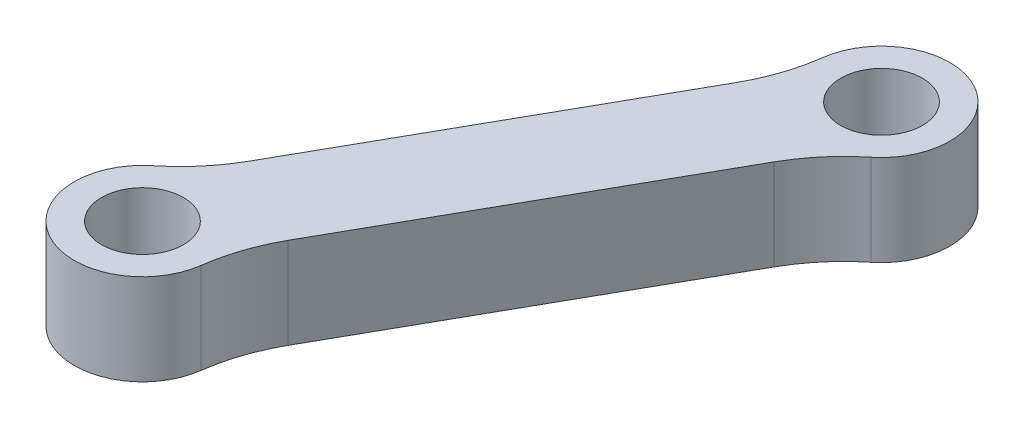
ISO-10303-21;
HEADER;
FILE_DESCRIPTION(('STEP AP214'),'2;1');
FILE_NAME('part.step','',(''),(''),'','','');
FILE_SCHEMA(('AUTOMOTIVE_DESIGN { 1 0 10303 214 1 1 1 1 }'));
ENDSEC;
DATA;
#1=APPLICATION_CONTEXT('core data for automotive mechanical design processes');
#2=APPLICATION_PROTOCOL_DEFINITION('international standard','automotive_design',2000,#1);
#3=PRODUCT_CONTEXT('',#1,'mechanical');
#4=PRODUCT('Part','Part','',(#3));
#5=PRODUCT_RELATED_PRODUCT_CATEGORY('part','',(#4));
#6=PRODUCT_DEFINITION_FORMATION('','',#4);
#7=PRODUCT_DEFINITION_CONTEXT('part definition',#1,'design');
#8=PRODUCT_DEFINITION('design','',#6,#7);
#9=PRODUCT_DEFINITION_SHAPE('','',#8);
#10=(LENGTH_UNIT() NAMED_UNIT(*) SI_UNIT(.MILLI.,.METRE.));
#11=(NAMED_UNIT(*) PLANE_ANGLE_UNIT() SI_UNIT($,.RADIAN.));
#12=(NAMED_UNIT(*) SI_UNIT($,.STERADIAN.) SOLID_ANGLE_UNIT());
#13=UNCERTAINTY_MEASURE_WITH_UNIT(LENGTH_MEASURE(1.E-05),#10,'distance_accuracy_value','');
#14=(GEOMETRIC_REPRESENTATION_CONTEXT(3) GLOBAL_UNCERTAINTY_ASSIGNED_CONTEXT((#13)) GLOBAL_UNIT_ASSIGNED_CONTEXT((#10,
#11,#12)) REPRESENTATION_CONTEXT('',''));
#15=CARTESIAN_POINT('',(0.,0.,0.));
#16=DIRECTION('',(0.,0.,1.));
#17=DIRECTION('',(1.,0.,0.));
#18=AXIS2_PLACEMENT_3D('',#15,#16,#17);
#19=CARTESIAN_POINT('',(-0.531717418692566,-58.,-21.5120788638868));
#20=DIRECTION('',(0.,-1.,0.));
#21=DIRECTION('',(0.,0.,-1.));
#22=AXIS2_PLACEMENT_3D('',#19,#20,#21);
#23=CYLINDRICAL_SURFACE('',#22,9.99999999999997);
#24=CARTESIAN_POINT('',(-0.531717418692566,-63.,-21.5120788638868));
#25=DIRECTION('',(0.,1.,0.));
#26=DIRECTION('',(0.,0.,1.));
#27=AXIS2_PLACEMENT_3D('',#24,#25,#26);
#28=CIRCLE('',#27,9.99999999999997);
#29=CARTESIAN_POINT('',(5.73851095756386,-63.,-13.7220701277179));
#30=VERTEX_POINT('',#29);
#31=CARTESIAN_POINT('',(8.18192841407054,-63.,-16.6057180637448));
#32=VERTEX_POINT('',#31);
#33=EDGE_CURVE('E142',#30,#32,#28,.T.);
#34=ORIENTED_EDGE('',*,*,#33,.F.);
#35=DIRECTION('',(0.,-1.,0.));
#36=VECTOR('',#35,1.);
#37=CARTESIAN_POINT('',(5.73851095756386,-58.,-13.7220701277179));
#38=LINE('',#37,#36);
#39=CARTESIAN_POINT('',(5.73851095756386,-58.,-13.7220701277179));
#40=VERTEX_POINT('',#39);
#41=EDGE_CURVE('E11',#40,#30,#38,.T.);
#42=ORIENTED_EDGE('',*,*,#41,.F.);
#43=CARTESIAN_POINT('',(-0.531717418692566,-58.,-21.5120788638868));
#44=DIRECTION('',(0.,1.,0.));
#45=DIRECTION('',(0.,0.,1.));
#46=AXIS2_PLACEMENT_3D('',#43,#44,#45);
#47=CIRCLE('',#46,9.99999999999997);
#48=CARTESIAN_POINT('',(8.18192841407054,-58.,-16.6057180637448));
#49=VERTEX_POINT('',#48);
#50=EDGE_CURVE('E171',#40,#49,#47,.T.);
#51=ORIENTED_EDGE('',*,*,#50,.T.);
#52=DIRECTION('',(0.,-1.,0.));
#53=VECTOR('',#52,1.);
#54=CARTESIAN_POINT('',(8.18192841407054,-58.,-16.6057180637448));
#55=LINE('',#54,#53);
#56=EDGE_CURVE('E42',#49,#32,#55,.T.);
#57=ORIENTED_EDGE('',*,*,#56,.T.);
#58=EDGE_LOOP('',(#34,#42,#51,#57));
#59=FACE_BOUND('',#58,.T.);
#60=ADVANCED_FACE('F39',(#59),#23,.F.);
#61=CARTESIAN_POINT('',(8.08984659866003,-58.,-10.8008168516545));
#62=DIRECTION('',(0.,-1.,0.));
#63=DIRECTION('',(0.,0.,-1.));
#64=AXIS2_PLACEMENT_3D('',#61,#62,#63);
#65=CYLINDRICAL_SURFACE('',#64,3.75000000000002);
#66=CARTESIAN_POINT('',(8.08984659866003,-63.,-10.8008168516545));
#67=DIRECTION('',(0.,-1.,0.));
#68=DIRECTION('',(0.,0.,-1.));
#69=AXIS2_PLACEMENT_3D('',#66,#67,#68);
#70=CIRCLE('',#69,3.75000000000002);
#71=CARTESIAN_POINT('',(11.8069428768096,-63.,-10.3051402847618));
#72=VERTEX_POINT('',#71);
#73=EDGE_CURVE('E168',#72,#30,#70,.T.);
#74=ORIENTED_EDGE('',*,*,#73,.F.);
#75=DIRECTION('',(0.,-1.,0.));
#76=VECTOR('',#75,1.);
#77=CARTESIAN_POINT('',(11.8069428768096,-58.,-10.3051402847618));
#78=LINE('',#77,#76);
#79=CARTESIAN_POINT('',(11.8069428768096,-58.,-10.3051402847618));
#80=VERTEX_POINT('',#79);
#81=EDGE_CURVE('E49',#80,#72,#78,.T.);
#82=ORIENTED_EDGE('',*,*,#81,.F.);
#83=CARTESIAN_POINT('',(8.08984659866003,-58.,-10.8008168516545));
#84=DIRECTION('',(0.,-1.,0.));
#85=DIRECTION('',(0.,0.,-1.));
#86=AXIS2_PLACEMENT_3D('',#83,#84,#85);
#87=CIRCLE('',#86,3.75000000000002);
#88=EDGE_CURVE('E128',#80,#40,#87,.T.);
#89=ORIENTED_EDGE('',*,*,#88,.T.);
#90=ORIENTED_EDGE('',*,*,#41,.T.);
#91=EDGE_LOOP('',(#74,#82,#89,#90));
#92=FACE_BOUND('',#91,.T.);
#93=ADVANCED_FACE('F189',(#92),#65,.T.);
#94=CARTESIAN_POINT('',(21.7191996185418,-58.,-8.9833361063813));
#95=DIRECTION('',(0.,-1.,0.));
#96=DIRECTION('',(0.,0.,-1.));
#97=AXIS2_PLACEMENT_3D('',#94,#95,#96);
#98=CYLINDRICAL_SURFACE('',#97,9.99999999999997);
#99=CARTESIAN_POINT('',(21.7191996185418,-63.,-8.9833361063813));
#100=DIRECTION('',(0.,1.,0.));
#101=DIRECTION('',(0.,0.,1.));
#102=AXIS2_PLACEMENT_3D('',#99,#100,#101);
#103=CIRCLE('',#102,9.99999999999997);
#104=CARTESIAN_POINT('',(13.0055537857787,-63.,-13.8896969065233));
#105=VERTEX_POINT('',#104);
#106=EDGE_CURVE('E114',#105,#72,#103,.T.);
#107=ORIENTED_EDGE('',*,*,#106,.F.);
#108=DIRECTION('',(0.,-1.,0.));
#109=VECTOR('',#108,1.);
#110=CARTESIAN_POINT('',(13.0055537857787,-58.,-13.8896969065233));
#111=LINE('',#110,#109);
#112=CARTESIAN_POINT('',(13.0055537857787,-58.,-13.8896969065233));
#113=VERTEX_POINT('',#112);
#114=EDGE_CURVE('E109',#113,#105,#111,.T.);
#115=ORIENTED_EDGE('',*,*,#114,.F.);
#116=CARTESIAN_POINT('',(21.7191996185418,-58.,-8.9833361063813));
#117=DIRECTION('',(0.,1.,0.));
#118=DIRECTION('',(0.,0.,1.));
#119=AXIS2_PLACEMENT_3D('',#116,#117,#118);
#120=CIRCLE('',#119,9.99999999999997);
#121=EDGE_CURVE('E112',#113,#80,#120,.T.);
#122=ORIENTED_EDGE('',*,*,#121,.T.);
#123=ORIENTED_EDGE('',*,*,#81,.T.);
#124=EDGE_LOOP('',(#107,#115,#122,#123));
#125=FACE_BOUND('',#124,.T.);
#126=ADVANCED_FACE('F111',(#125),#98,.F.);
#127=CARTESIAN_POINT('',(22.6257964745386,-58.,-30.9751480239088));
#128=DIRECTION('',(0.871364583276312,0.,0.490636080014199));
#129=DIRECTION('',(0.490636080014199,0.,-0.871364583276312));
#130=AXIS2_PLACEMENT_3D('',#127,#128,#129);
#131=PLANE('',#130);
#132=DIRECTION('',(-0.490636080014198,0.,0.871364583276312));
#133=VECTOR('',#132,1.);
#134=CARTESIAN_POINT('',(22.6257964745386,-63.,-30.9751480239088));
#135=LINE('',#134,#133);
#136=CARTESIAN_POINT('',(22.6257964745386,-63.,-30.9751480239088));
#137=VERTEX_POINT('',#136);
#138=EDGE_CURVE('E163',#137,#105,#135,.T.);
#139=ORIENTED_EDGE('',*,*,#138,.F.);
#140=DIRECTION('',(0.,-1.,0.));
#141=VECTOR('',#140,1.);
#142=CARTESIAN_POINT('',(22.6257964745386,-58.,-30.9751480239088));
#143=LINE('',#142,#141);
#144=CARTESIAN_POINT('',(22.6257964745386,-58.,-30.9751480239088));
#145=VERTEX_POINT('',#144);
#146=EDGE_CURVE('E120',#145,#137,#143,.T.);
#147=ORIENTED_EDGE('',*,*,#146,.F.);
#148=DIRECTION('',(-0.490636080014198,0.,0.871364583276312));
#149=VECTOR('',#148,1.);
#150=CARTESIAN_POINT('',(22.6257964745386,-58.,-30.9751480239088));
#151=LINE('',#150,#149);
#152=EDGE_CURVE('E126',#145,#113,#151,.T.);
#153=ORIENTED_EDGE('',*,*,#152,.T.);
#154=ORIENTED_EDGE('',*,*,#114,.T.);
#155=EDGE_LOOP('',(#139,#147,#153,#154));
#156=FACE_BOUND('',#155,.T.);
#157=ADVANCED_FACE('F131',(#156),#131,.T.);
#158=CARTESIAN_POINT('',(31.3394423073017,-58.,-26.0687872237669));
#159=DIRECTION('',(0.,-1.,0.));
#160=DIRECTION('',(0.,0.,-1.));
#161=AXIS2_PLACEMENT_3D('',#158,#159,#160);
#162=CYLINDRICAL_SURFACE('',#161,9.99999999999996);
#163=CARTESIAN_POINT('',(31.3394423073017,-63.,-26.0687872237669));
#164=DIRECTION('',(0.,1.,0.));
#165=DIRECTION('',(0.,0.,1.));
#166=AXIS2_PLACEMENT_3D('',#163,#164,#165);
#167=CIRCLE('',#166,9.99999999999996);
#168=CARTESIAN_POINT('',(25.0692139310453,-63.,-33.8587959599358));
#169=VERTEX_POINT('',#168);
#170=EDGE_CURVE('E159',#169,#137,#167,.T.);
#171=ORIENTED_EDGE('',*,*,#170,.F.);
#172=DIRECTION('',(0.,-1.,0.));
#173=VECTOR('',#172,1.);
#174=CARTESIAN_POINT('',(25.0692139310453,-58.,-33.8587959599358));
#175=LINE('',#174,#173);
#176=CARTESIAN_POINT('',(25.0692139310453,-58.,-33.8587959599358));
#177=VERTEX_POINT('',#176);
#178=EDGE_CURVE('E177',#177,#169,#175,.T.);
#179=ORIENTED_EDGE('',*,*,#178,.F.);
#180=CARTESIAN_POINT('',(31.3394423073017,-58.,-26.0687872237669));
#181=DIRECTION('',(0.,1.,0.));
#182=DIRECTION('',(0.,0.,1.));
#183=AXIS2_PLACEMENT_3D('',#180,#181,#182);
#184=CIRCLE('',#183,9.99999999999996);
#185=EDGE_CURVE('E133',#177,#145,#184,.T.);
#186=ORIENTED_EDGE('',*,*,#185,.T.);
#187=ORIENTED_EDGE('',*,*,#146,.T.);
#188=EDGE_LOOP('',(#171,#179,#186,#187));
#189=FACE_BOUND('',#188,.T.);
#190=ADVANCED_FACE('F202',(#189),#162,.F.);
#191=CARTESIAN_POINT('',(22.7178782899491,-58.,-36.7800492359991));
#192=DIRECTION('',(0.,-1.,0.));
#193=DIRECTION('',(0.,0.,-1.));
#194=AXIS2_PLACEMENT_3D('',#191,#192,#193);
#195=CYLINDRICAL_SURFACE('',#194,3.75);
#196=CARTESIAN_POINT('',(22.7178782899491,-63.,-36.7800492359991));
#197=DIRECTION('',(0.,-1.,0.));
#198=DIRECTION('',(0.,0.,-1.));
#199=AXIS2_PLACEMENT_3D('',#196,#197,#198);
#200=CIRCLE('',#199,3.75);
#201=CARTESIAN_POINT('',(19.0007820117995,-63.,-37.2757258028918));
#202=VERTEX_POINT('',#201);
#203=EDGE_CURVE('E155',#202,#169,#200,.T.);
#204=ORIENTED_EDGE('',*,*,#203,.F.);
#205=DIRECTION('',(0.,-1.,0.));
#206=VECTOR('',#205,1.);
#207=CARTESIAN_POINT('',(19.0007820117995,-58.,-37.2757258028918));
#208=LINE('',#207,#206);
#209=CARTESIAN_POINT('',(19.0007820117995,-58.,-37.2757258028918));
#210=VERTEX_POINT('',#209);
#211=EDGE_CURVE('E180',#210,#202,#208,.T.);
#212=ORIENTED_EDGE('',*,*,#211,.F.);
#213=CARTESIAN_POINT('',(22.7178782899491,-58.,-36.7800492359991));
#214=DIRECTION('',(0.,-1.,0.));
#215=DIRECTION('',(0.,0.,-1.));
#216=AXIS2_PLACEMENT_3D('',#213,#214,#215);
#217=CIRCLE('',#216,3.75);
#218=EDGE_CURVE('E136',#210,#177,#217,.T.);
#219=ORIENTED_EDGE('',*,*,#218,.T.);
#220=ORIENTED_EDGE('',*,*,#178,.T.);
#221=EDGE_LOOP('',(#204,#212,#219,#220));
#222=FACE_BOUND('',#221,.T.);
#223=ADVANCED_FACE('F205',(#222),#195,.T.);
#224=CARTESIAN_POINT('',(9.0885252700673,-58.,-38.5975299812723));
#225=DIRECTION('',(0.,-1.,0.));
#226=DIRECTION('',(0.,0.,-1.));
#227=AXIS2_PLACEMENT_3D('',#224,#225,#226);
#228=CYLINDRICAL_SURFACE('',#227,9.99999999999998);
#229=CARTESIAN_POINT('',(9.0885252700673,-63.,-38.5975299812723));
#230=DIRECTION('',(0.,1.,0.));
#231=DIRECTION('',(0.,0.,1.));
#232=AXIS2_PLACEMENT_3D('',#229,#230,#231);
#233=CIRCLE('',#232,9.99999999999998);
#234=CARTESIAN_POINT('',(17.8021711028304,-63.,-33.6911691811303));
#235=VERTEX_POINT('',#234);
#236=EDGE_CURVE('E151',#235,#202,#233,.T.);
#237=ORIENTED_EDGE('',*,*,#236,.F.);
#238=DIRECTION('',(0.,-1.,0.));
#239=VECTOR('',#238,1.);
#240=CARTESIAN_POINT('',(17.8021711028304,-58.,-33.6911691811303));
#241=LINE('',#240,#239);
#242=CARTESIAN_POINT('',(17.8021711028304,-58.,-33.6911691811303));
#243=VERTEX_POINT('',#242);
#244=EDGE_CURVE('E182',#243,#235,#241,.T.);
#245=ORIENTED_EDGE('',*,*,#244,.F.);
#246=CARTESIAN_POINT('',(9.0885252700673,-58.,-38.5975299812723));
#247=DIRECTION('',(0.,1.,0.));
#248=DIRECTION('',(0.,0.,1.));
#249=AXIS2_PLACEMENT_3D('',#246,#247,#248);
#250=CIRCLE('',#249,9.99999999999998);
#251=EDGE_CURVE('E257',#243,#210,#250,.T.);
#252=ORIENTED_EDGE('',*,*,#251,.T.);
#253=ORIENTED_EDGE('',*,*,#211,.T.);
#254=EDGE_LOOP('',(#237,#245,#252,#253));
#255=FACE_BOUND('',#254,.T.);
#256=ADVANCED_FACE('F209',(#255),#228,.F.);
#257=CARTESIAN_POINT('',(8.18192841407054,-58.,-16.6057180637448));
#258=DIRECTION('',(-0.871364583276312,0.,-0.490636080014198));
#259=DIRECTION('',(-0.490636080014198,0.,0.871364583276312));
#260=AXIS2_PLACEMENT_3D('',#257,#258,#259);
#261=PLANE('',#260);
#262=DIRECTION('',(0.490636080014198,0.,-0.871364583276312));
#263=VECTOR('',#262,1.);
#264=CARTESIAN_POINT('',(8.18192841407054,-63.,-16.6057180637448));
#265=LINE('',#264,#263);
#266=EDGE_CURVE('E146',#32,#235,#265,.T.);
#267=ORIENTED_EDGE('',*,*,#266,.F.);
#268=ORIENTED_EDGE('',*,*,#56,.F.);
#269=DIRECTION('',(0.490636080014198,0.,-0.871364583276312));
#270=VECTOR('',#269,1.);
#271=CARTESIAN_POINT('',(8.18192841407054,-58.,-16.6057180637448));
#272=LINE('',#271,#270);
#273=EDGE_CURVE('E254',#49,#243,#272,.T.);
#274=ORIENTED_EDGE('',*,*,#273,.T.);
#275=ORIENTED_EDGE('',*,*,#244,.T.);
#276=EDGE_LOOP('',(#267,#268,#274,#275));
#277=FACE_BOUND('',#276,.T.);
#278=ADVANCED_FACE('F186',(#277),#261,.T.);
#279=CARTESIAN_POINT('',(-0.531717418692566,-58.,-21.5120788638868));
#280=DIRECTION('',(0.,1.,0.));
#281=DIRECTION('',(0.,0.,1.));
#282=AXIS2_PLACEMENT_3D('',#279,#280,#281);
#283=PLANE('',#282);
#284=CARTESIAN_POINT('',(8.08984659866003,-58.,-10.8008168516545));
#285=DIRECTION('',(0.,-1.,0.));
#286=DIRECTION('',(0.,0.,1.));
#287=AXIS2_PLACEMENT_3D('',#284,#285,#286);
#288=CIRCLE('',#287,2.25);
#289=CARTESIAN_POINT('',(8.08984659866003,-58.,-8.5508168516545));
#290=VERTEX_POINT('',#289);
#291=EDGE_CURVE('E236',#290,#290,#288,.T.);
#292=ORIENTED_EDGE('',*,*,#291,.T.);
#293=EDGE_LOOP('',(#292));
#294=FACE_BOUND('',#293,.T.);
#295=CARTESIAN_POINT('',(22.7178782899491,-58.,-36.7800492359991));
#296=DIRECTION('',(0.,-1.,0.));
#297=DIRECTION('',(0.,0.,1.));
#298=AXIS2_PLACEMENT_3D('',#295,#296,#297);
#299=CIRCLE('',#298,2.25);
#300=CARTESIAN_POINT('',(22.7178782899491,-58.,-34.5300492359991));
#301=VERTEX_POINT('',#300);
#302=EDGE_CURVE('E147',#301,#301,#299,.T.);
#303=ORIENTED_EDGE('',*,*,#302,.T.);
#304=EDGE_LOOP('',(#303));
#305=FACE_BOUND('',#304,.T.);
#306=ORIENTED_EDGE('',*,*,#50,.F.);
#307=ORIENTED_EDGE('',*,*,#88,.F.);
#308=ORIENTED_EDGE('',*,*,#121,.F.);
#309=ORIENTED_EDGE('',*,*,#152,.F.);
#310=ORIENTED_EDGE('',*,*,#185,.F.);
#311=ORIENTED_EDGE('',*,*,#218,.F.);
#312=ORIENTED_EDGE('',*,*,#251,.F.);
#313=ORIENTED_EDGE('',*,*,#273,.F.);
#314=EDGE_LOOP('',(#306,#307,#308,#309,#310,#311,#312,#313));
#315=FACE_BOUND('',#314,.T.);
#316=ADVANCED_FACE('F124',(#294,#305,#315),#283,.T.);
#317=CARTESIAN_POINT('',(-0.531717418692566,-63.,-21.5120788638868));
#318=DIRECTION('',(0.,1.,0.));
#319=DIRECTION('',(0.,0.,1.));
#320=AXIS2_PLACEMENT_3D('',#317,#318,#319);
#321=PLANE('',#320);
#322=CARTESIAN_POINT('',(8.08984659866003,-63.,-10.8008168516545));
#323=DIRECTION('',(0.,-1.,0.));
#324=DIRECTION('',(0.,0.,1.));
#325=AXIS2_PLACEMENT_3D('',#322,#323,#324);
#326=CIRCLE('',#325,2.25);
#327=CARTESIAN_POINT('',(8.08984659866003,-63.,-8.5508168516545));
#328=VERTEX_POINT('',#327);
#329=EDGE_CURVE('E239',#328,#328,#326,.T.);
#330=ORIENTED_EDGE('',*,*,#329,.F.);
#331=EDGE_LOOP('',(#330));
#332=FACE_BOUND('',#331,.T.);
#333=CARTESIAN_POINT('',(22.7178782899491,-63.,-36.7800492359991));
#334=DIRECTION('',(0.,-1.,0.));
#335=DIRECTION('',(0.,0.,1.));
#336=AXIS2_PLACEMENT_3D('',#333,#334,#335);
#337=CIRCLE('',#336,2.25);
#338=CARTESIAN_POINT('',(22.7178782899491,-63.,-34.5300492359991));
#339=VERTEX_POINT('',#338);
#340=EDGE_CURVE('E243',#339,#339,#337,.T.);
#341=ORIENTED_EDGE('',*,*,#340,.F.);
#342=EDGE_LOOP('',(#341));
#343=FACE_BOUND('',#342,.T.);
#344=ORIENTED_EDGE('',*,*,#33,.T.);
#345=ORIENTED_EDGE('',*,*,#266,.T.);
#346=ORIENTED_EDGE('',*,*,#236,.T.);
#347=ORIENTED_EDGE('',*,*,#203,.T.);
#348=ORIENTED_EDGE('',*,*,#170,.T.);
#349=ORIENTED_EDGE('',*,*,#138,.T.);
#350=ORIENTED_EDGE('',*,*,#106,.T.);
#351=ORIENTED_EDGE('',*,*,#73,.T.);
#352=EDGE_LOOP('',(#344,#345,#346,#347,#348,#349,#350,#351));
#353=FACE_BOUND('',#352,.T.);
#354=ADVANCED_FACE('F188',(#332,#343,#353),#321,.F.);
#355=CARTESIAN_POINT('',(22.7178782899491,-58.,-36.7800492359991));
#356=DIRECTION('',(0.,-1.,0.));
#357=DIRECTION('',(0.,0.,-1.));
#358=AXIS2_PLACEMENT_3D('',#355,#356,#357);
#359=CYLINDRICAL_SURFACE('',#358,2.25);
#360=ORIENTED_EDGE('',*,*,#302,.F.);
#361=EDGE_LOOP('',(#360));
#362=FACE_BOUND('',#361,.T.);
#363=ORIENTED_EDGE('',*,*,#340,.T.);
#364=EDGE_LOOP('',(#363));
#365=FACE_BOUND('',#364,.T.);
#366=ADVANCED_FACE('F221',(#362,#365),#359,.F.);
#367=CARTESIAN_POINT('',(8.08984659866003,-58.,-10.8008168516545));
#368=DIRECTION('',(0.,-1.,0.));
#369=DIRECTION('',(0.,0.,-1.));
#370=AXIS2_PLACEMENT_3D('',#367,#368,#369);
#371=CYLINDRICAL_SURFACE('',#370,2.25);
#372=ORIENTED_EDGE('',*,*,#291,.F.);
#373=EDGE_LOOP('',(#372));
#374=FACE_BOUND('',#373,.T.);
#375=ORIENTED_EDGE('',*,*,#329,.T.);
#376=EDGE_LOOP('',(#375));
#377=FACE_BOUND('',#376,.T.);
#378=ADVANCED_FACE('F228',(#374,#377),#371,.F.);
#379=CLOSED_SHELL('',(#60,#93,#126,#157,#190,#223,#256,#278,#316,#354,#366,#378));
#380=MANIFOLD_SOLID_BREP('B2',#379);
#381=ADVANCED_BREP_SHAPE_REPRESENTATION('',(#18,#380),#14);
#382=SHAPE_DEFINITION_REPRESENTATION(#9,#381);
ENDSEC;
END-ISO-10303-21;
